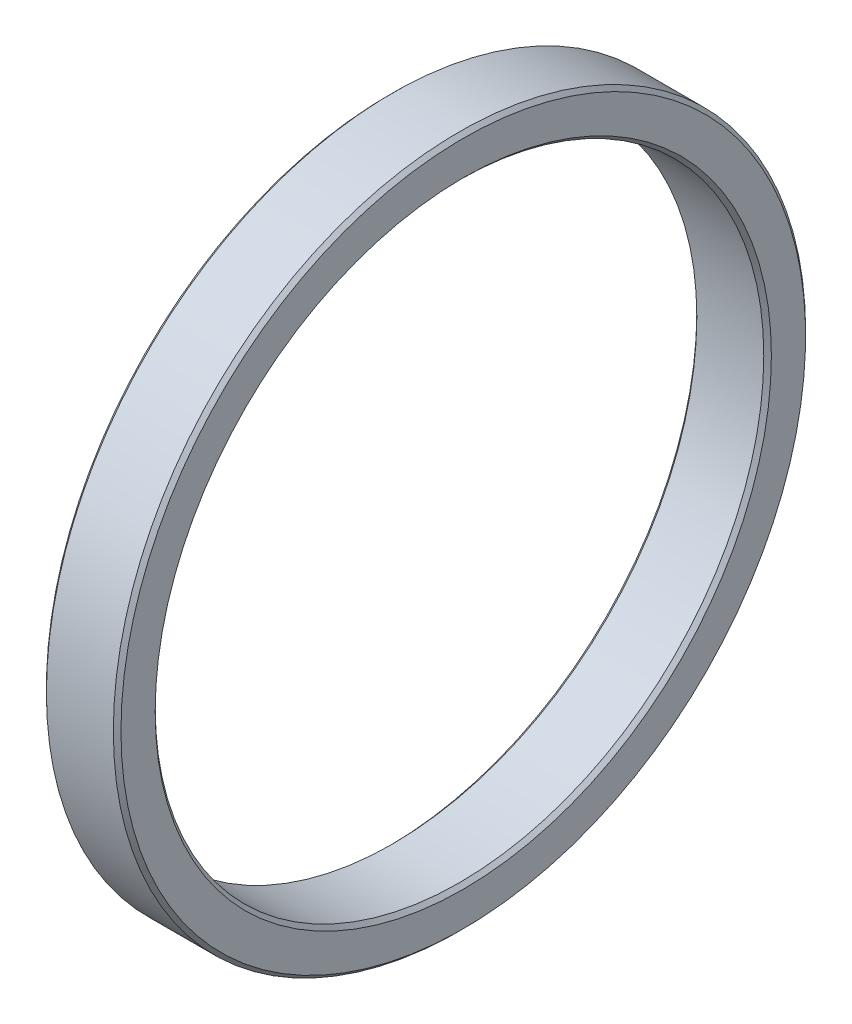
ISO-10303-21;
HEADER;
FILE_DESCRIPTION(('STEP AP214'),'2;1');
FILE_NAME('part.step','',(''),(''),'','','');
FILE_SCHEMA(('AUTOMOTIVE_DESIGN { 1 0 10303 214 1 1 1 1 }'));
ENDSEC;
DATA;
#1=APPLICATION_CONTEXT('core data for automotive mechanical design processes');
#2=APPLICATION_PROTOCOL_DEFINITION('international standard','automotive_design',2000,#1);
#3=PRODUCT_CONTEXT('',#1,'mechanical');
#4=PRODUCT('Part','Part','',(#3));
#5=PRODUCT_RELATED_PRODUCT_CATEGORY('part','',(#4));
#6=PRODUCT_DEFINITION_FORMATION('','',#4);
#7=PRODUCT_DEFINITION_CONTEXT('part definition',#1,'design');
#8=PRODUCT_DEFINITION('design','',#6,#7);
#9=PRODUCT_DEFINITION_SHAPE('','',#8);
#10=(LENGTH_UNIT() NAMED_UNIT(*) SI_UNIT(.MILLI.,.METRE.));
#11=(NAMED_UNIT(*) PLANE_ANGLE_UNIT() SI_UNIT($,.RADIAN.));
#12=(NAMED_UNIT(*) SI_UNIT($,.STERADIAN.) SOLID_ANGLE_UNIT());
#13=UNCERTAINTY_MEASURE_WITH_UNIT(LENGTH_MEASURE(1.E-05),#10,'distance_accuracy_value','');
#14=(GEOMETRIC_REPRESENTATION_CONTEXT(3) GLOBAL_UNCERTAINTY_ASSIGNED_CONTEXT((#13)) GLOBAL_UNIT_ASSIGNED_CONTEXT((#10,
#11,#12)) REPRESENTATION_CONTEXT('',''));
#15=CARTESIAN_POINT('',(0.,0.,0.));
#16=DIRECTION('',(0.,0.,1.));
#17=DIRECTION('',(1.,0.,0.));
#18=AXIS2_PLACEMENT_3D('',#15,#16,#17);
#19=CARTESIAN_POINT('',(0.,0.,0.));
#20=DIRECTION('',(1.,0.,0.));
#21=DIRECTION('',(0.,0.,-1.));
#22=AXIS2_PLACEMENT_3D('',#19,#20,#21);
#23=PLANE('',#22);
#24=CARTESIAN_POINT('',(0.,0.,0.));
#25=DIRECTION('',(1.,0.,0.));
#26=DIRECTION('',(0.,0.,-1.));
#27=AXIS2_PLACEMENT_3D('',#24,#25,#26);
#28=CIRCLE('',#27,40.5);
#29=CARTESIAN_POINT('',(0.,0.,-40.5));
#30=VERTEX_POINT('',#29);
#31=EDGE_CURVE('E56',#30,#30,#28,.T.);
#32=ORIENTED_EDGE('',*,*,#31,.T.);
#33=EDGE_LOOP('',(#32));
#34=FACE_BOUND('',#33,.T.);
#35=CARTESIAN_POINT('',(0.,0.,0.));
#36=DIRECTION('',(1.,0.,0.));
#37=DIRECTION('',(0.,0.,-1.));
#38=AXIS2_PLACEMENT_3D('',#35,#36,#37);
#39=CIRCLE('',#38,45.);
#40=CARTESIAN_POINT('',(0.,0.,-45.));
#41=VERTEX_POINT('',#40);
#42=EDGE_CURVE('E59',#41,#41,#39,.F.);
#43=ORIENTED_EDGE('',*,*,#42,.T.);
#44=EDGE_LOOP('',(#43));
#45=FACE_BOUND('',#44,.T.);
#46=ADVANCED_FACE('F35',(#34,#45),#23,.F.);
#47=CARTESIAN_POINT('',(0.,0.,0.));
#48=DIRECTION('',(-1.,0.,0.));
#49=DIRECTION('',(0.,0.,1.));
#50=AXIS2_PLACEMENT_3D('',#47,#48,#49);
#51=CYLINDRICAL_SURFACE('',#50,40.);
#52=CARTESIAN_POINT('',(0.500000000000007,0.,0.));
#53=DIRECTION('',(1.,0.,0.));
#54=DIRECTION('',(0.,0.,-1.));
#55=AXIS2_PLACEMENT_3D('',#52,#53,#54);
#56=CIRCLE('',#55,40.);
#57=CARTESIAN_POINT('',(0.500000000000007,0.,-40.));
#58=VERTEX_POINT('',#57);
#59=EDGE_CURVE('E62',#58,#58,#56,.F.);
#60=ORIENTED_EDGE('',*,*,#59,.T.);
#61=EDGE_LOOP('',(#60));
#62=FACE_BOUND('',#61,.T.);
#63=CARTESIAN_POINT('',(9.3,0.,0.));
#64=DIRECTION('',(-1.,0.,0.));
#65=DIRECTION('',(0.,0.,1.));
#66=AXIS2_PLACEMENT_3D('',#63,#64,#65);
#67=CIRCLE('',#66,40.);
#68=CARTESIAN_POINT('',(9.3,0.,40.));
#69=VERTEX_POINT('',#68);
#70=EDGE_CURVE('E65',#69,#69,#67,.F.);
#71=ORIENTED_EDGE('',*,*,#70,.T.);
#72=EDGE_LOOP('',(#71));
#73=FACE_BOUND('',#72,.T.);
#74=ADVANCED_FACE('F69',(#62,#73),#51,.F.);
#75=CARTESIAN_POINT('',(9.8,0.,0.));
#76=DIRECTION('',(-1.,0.,0.));
#77=DIRECTION('',(0.,0.,1.));
#78=AXIS2_PLACEMENT_3D('',#75,#76,#77);
#79=PLANE('',#78);
#80=CARTESIAN_POINT('',(9.8,0.,0.));
#81=DIRECTION('',(-1.,0.,0.));
#82=DIRECTION('',(0.,0.,1.));
#83=AXIS2_PLACEMENT_3D('',#80,#81,#82);
#84=CIRCLE('',#83,40.5);
#85=CARTESIAN_POINT('',(9.8,0.,40.5));
#86=VERTEX_POINT('',#85);
#87=EDGE_CURVE('E10',#86,#86,#84,.T.);
#88=ORIENTED_EDGE('',*,*,#87,.T.);
#89=EDGE_LOOP('',(#88));
#90=FACE_BOUND('',#89,.T.);
#91=CARTESIAN_POINT('',(9.8,0.,0.));
#92=DIRECTION('',(-1.,0.,0.));
#93=DIRECTION('',(0.,0.,1.));
#94=AXIS2_PLACEMENT_3D('',#91,#92,#93);
#95=CIRCLE('',#94,45.);
#96=CARTESIAN_POINT('',(9.8,0.,45.));
#97=VERTEX_POINT('',#96);
#98=EDGE_CURVE('E43',#97,#97,#95,.F.);
#99=ORIENTED_EDGE('',*,*,#98,.T.);
#100=EDGE_LOOP('',(#99));
#101=FACE_BOUND('',#100,.T.);
#102=ADVANCED_FACE('F90',(#90,#101),#79,.F.);
#103=CARTESIAN_POINT('',(0.,0.,0.));
#104=DIRECTION('',(-1.,0.,0.));
#105=DIRECTION('',(0.,0.,1.));
#106=AXIS2_PLACEMENT_3D('',#103,#104,#105);
#107=CYLINDRICAL_SURFACE('',#106,45.5);
#108=CARTESIAN_POINT('',(0.499999999999994,0.,0.));
#109=DIRECTION('',(1.,0.,0.));
#110=DIRECTION('',(0.,0.,-1.));
#111=AXIS2_PLACEMENT_3D('',#108,#109,#110);
#112=CIRCLE('',#111,45.5);
#113=CARTESIAN_POINT('',(0.499999999999994,0.,-45.5));
#114=VERTEX_POINT('',#113);
#115=EDGE_CURVE('E47',#114,#114,#112,.T.);
#116=ORIENTED_EDGE('',*,*,#115,.T.);
#117=EDGE_LOOP('',(#116));
#118=FACE_BOUND('',#117,.T.);
#119=CARTESIAN_POINT('',(9.3,0.,0.));
#120=DIRECTION('',(-1.,0.,0.));
#121=DIRECTION('',(0.,0.,1.));
#122=AXIS2_PLACEMENT_3D('',#119,#120,#121);
#123=CIRCLE('',#122,45.5);
#124=CARTESIAN_POINT('',(9.3,0.,45.5));
#125=VERTEX_POINT('',#124);
#126=EDGE_CURVE('E51',#125,#125,#123,.T.);
#127=ORIENTED_EDGE('',*,*,#126,.T.);
#128=EDGE_LOOP('',(#127));
#129=FACE_BOUND('',#128,.T.);
#130=ADVANCED_FACE('F101',(#118,#129),#107,.T.);
#131=CARTESIAN_POINT('',(0.500000000000007,0.,0.));
#132=DIRECTION('',(-1.,0.,0.));
#133=DIRECTION('',(0.,0.,1.));
#134=AXIS2_PLACEMENT_3D('',#131,#132,#133);
#135=CONICAL_SURFACE('',#134,40.,0.785398163397434);
#136=ORIENTED_EDGE('',*,*,#31,.F.);
#137=EDGE_LOOP('',(#136));
#138=FACE_BOUND('',#137,.T.);
#139=ORIENTED_EDGE('',*,*,#59,.F.);
#140=EDGE_LOOP('',(#139));
#141=FACE_BOUND('',#140,.T.);
#142=ADVANCED_FACE('F80',(#138,#141),#135,.F.);
#143=CARTESIAN_POINT('',(0.,0.,0.));
#144=DIRECTION('',(1.,0.,0.));
#145=DIRECTION('',(0.,0.,-1.));
#146=AXIS2_PLACEMENT_3D('',#143,#144,#145);
#147=CONICAL_SURFACE('',#146,45.,0.785398163397441);
#148=ORIENTED_EDGE('',*,*,#115,.F.);
#149=EDGE_LOOP('',(#148));
#150=FACE_BOUND('',#149,.T.);
#151=ORIENTED_EDGE('',*,*,#42,.F.);
#152=EDGE_LOOP('',(#151));
#153=FACE_BOUND('',#152,.T.);
#154=ADVANCED_FACE('F74',(#150,#153),#147,.T.);
#155=CARTESIAN_POINT('',(9.8,0.,0.));
#156=DIRECTION('',(1.,0.,0.));
#157=DIRECTION('',(0.,0.,-1.));
#158=AXIS2_PLACEMENT_3D('',#155,#156,#157);
#159=CONICAL_SURFACE('',#158,40.5,0.785398163397441);
#160=ORIENTED_EDGE('',*,*,#70,.F.);
#161=EDGE_LOOP('',(#160));
#162=FACE_BOUND('',#161,.T.);
#163=ORIENTED_EDGE('',*,*,#87,.F.);
#164=EDGE_LOOP('',(#163));
#165=FACE_BOUND('',#164,.T.);
#166=ADVANCED_FACE('F71',(#162,#165),#159,.F.);
#167=CARTESIAN_POINT('',(9.3,0.,0.));
#168=DIRECTION('',(-1.,0.,0.));
#169=DIRECTION('',(0.,0.,1.));
#170=AXIS2_PLACEMENT_3D('',#167,#168,#169);
#171=CONICAL_SURFACE('',#170,45.5,0.785398163397448);
#172=ORIENTED_EDGE('',*,*,#98,.F.);
#173=EDGE_LOOP('',(#172));
#174=FACE_BOUND('',#173,.T.);
#175=ORIENTED_EDGE('',*,*,#126,.F.);
#176=EDGE_LOOP('',(#175));
#177=FACE_BOUND('',#176,.T.);
#178=ADVANCED_FACE('F38',(#174,#177),#171,.T.);
#179=CLOSED_SHELL('',(#46,#74,#102,#130,#142,#154,#166,#178));
#180=MANIFOLD_SOLID_BREP('B2',#179);
#181=ADVANCED_BREP_SHAPE_REPRESENTATION('',(#18,#180),#14);
#182=SHAPE_DEFINITION_REPRESENTATION(#9,#181);
ENDSEC;
END-ISO-10303-21;
